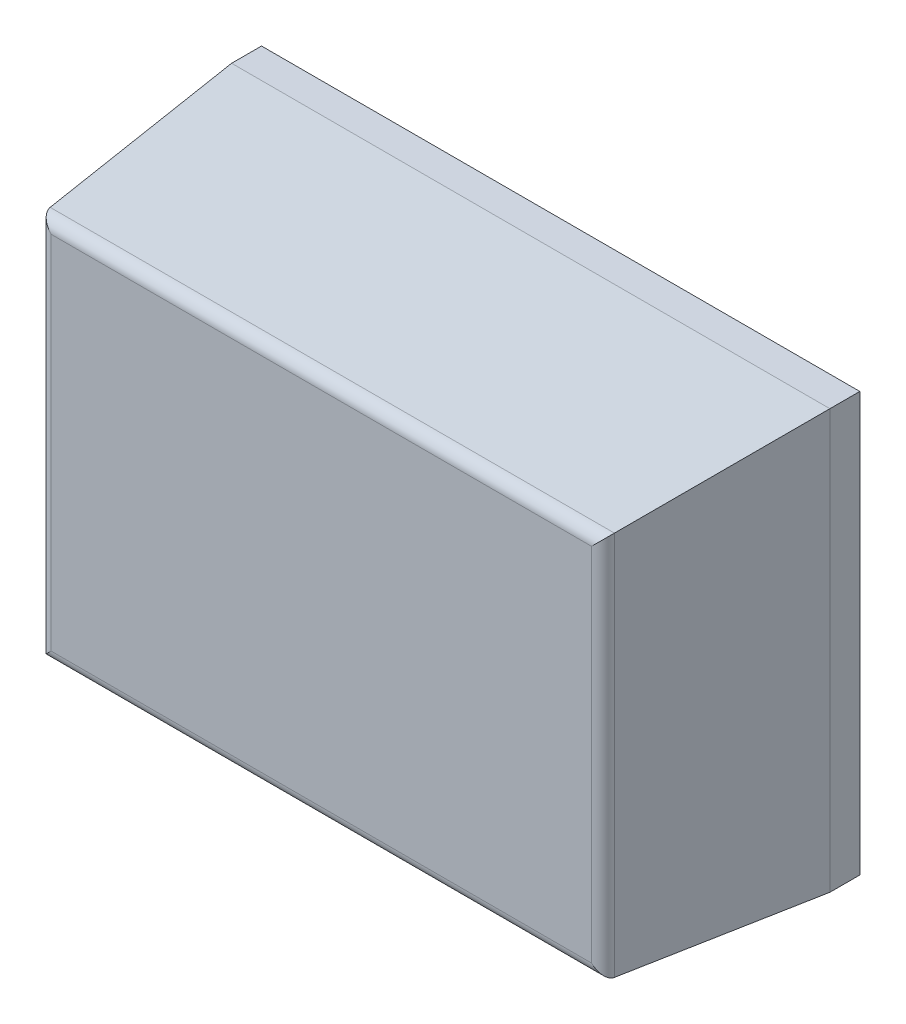
ISO-10303-21;
HEADER;
FILE_DESCRIPTION(('STEP AP214'),'2;1');
FILE_NAME('part.step','',(''),(''),'','','');
FILE_SCHEMA(('AUTOMOTIVE_DESIGN { 1 0 10303 214 1 1 1 1 }'));
ENDSEC;
DATA;
#1=APPLICATION_CONTEXT('core data for automotive mechanical design processes');
#2=APPLICATION_PROTOCOL_DEFINITION('international standard','automotive_design',2000,#1);
#3=PRODUCT_CONTEXT('',#1,'mechanical');
#4=PRODUCT('Part','Part','',(#3));
#5=PRODUCT_RELATED_PRODUCT_CATEGORY('part','',(#4));
#6=PRODUCT_DEFINITION_FORMATION('','',#4);
#7=PRODUCT_DEFINITION_CONTEXT('part definition',#1,'design');
#8=PRODUCT_DEFINITION('design','',#6,#7);
#9=PRODUCT_DEFINITION_SHAPE('','',#8);
#10=(LENGTH_UNIT() NAMED_UNIT(*) SI_UNIT(.MILLI.,.METRE.));
#11=(NAMED_UNIT(*) PLANE_ANGLE_UNIT() SI_UNIT($,.RADIAN.));
#12=(NAMED_UNIT(*) SI_UNIT($,.STERADIAN.) SOLID_ANGLE_UNIT());
#13=UNCERTAINTY_MEASURE_WITH_UNIT(LENGTH_MEASURE(1.E-05),#10,'distance_accuracy_value','');
#14=(GEOMETRIC_REPRESENTATION_CONTEXT(3) GLOBAL_UNCERTAINTY_ASSIGNED_CONTEXT((#13)) GLOBAL_UNIT_ASSIGNED_CONTEXT((#10,
#11,#12)) REPRESENTATION_CONTEXT('',''));
#15=CARTESIAN_POINT('',(0.,0.,0.));
#16=DIRECTION('',(0.,0.,1.));
#17=DIRECTION('',(1.,0.,0.));
#18=AXIS2_PLACEMENT_3D('',#15,#16,#17);
#19=CARTESIAN_POINT('',(-0.5,0.35,0.2));
#20=DIRECTION('',(0.,0.,1.));
#21=DIRECTION('',(1.,0.,0.));
#22=AXIS2_PLACEMENT_3D('',#19,#20,#21);
#23=PLANE('',#22);
#24=DIRECTION('',(0.,1.,0.));
#25=VECTOR('',#24,1.);
#26=CARTESIAN_POINT('',(0.5,0.35,0.2));
#27=LINE('',#26,#25);
#28=CARTESIAN_POINT('',(0.5,-0.35,0.2));
#29=VERTEX_POINT('',#28);
#30=CARTESIAN_POINT('',(0.5,0.35,0.2));
#31=VERTEX_POINT('',#30);
#32=EDGE_CURVE('E11',#29,#31,#27,.T.);
#33=ORIENTED_EDGE('',*,*,#32,.F.);
#34=DIRECTION('',(1.,0.,0.));
#35=VECTOR('',#34,1.);
#36=CARTESIAN_POINT('',(-0.5,-0.35,0.2));
#37=LINE('',#36,#35);
#38=CARTESIAN_POINT('',(-0.5,-0.35,0.2));
#39=VERTEX_POINT('',#38);
#40=EDGE_CURVE('E25',#39,#29,#37,.T.);
#41=ORIENTED_EDGE('',*,*,#40,.F.);
#42=DIRECTION('',(0.,-1.,0.));
#43=VECTOR('',#42,1.);
#44=CARTESIAN_POINT('',(-0.5,0.35,0.2));
#45=LINE('',#44,#43);
#46=CARTESIAN_POINT('',(-0.5,0.35,0.2));
#47=VERTEX_POINT('',#46);
#48=EDGE_CURVE('E217',#47,#39,#45,.T.);
#49=ORIENTED_EDGE('',*,*,#48,.F.);
#50=DIRECTION('',(-1.,0.,0.));
#51=VECTOR('',#50,1.);
#52=CARTESIAN_POINT('',(-0.5,0.35,0.2));
#53=LINE('',#52,#51);
#54=EDGE_CURVE('E212',#31,#47,#53,.T.);
#55=ORIENTED_EDGE('',*,*,#54,.F.);
#56=EDGE_LOOP('',(#33,#41,#49,#55));
#57=FACE_BOUND('',#56,.T.);
#58=ADVANCED_FACE('F17',(#57),#23,.F.);
#59=CARTESIAN_POINT('',(-0.5,0.35,0.2));
#60=DIRECTION('',(0.,1.,0.));
#61=DIRECTION('',(0.,0.,1.));
#62=AXIS2_PLACEMENT_3D('',#59,#60,#61);
#63=PLANE('',#62);
#64=DIRECTION('',(0.,0.,-1.));
#65=VECTOR('',#64,1.);
#66=CARTESIAN_POINT('',(0.5,0.35,0.2));
#67=LINE('',#66,#65);
#68=CARTESIAN_POINT('',(0.5,0.35,0.25));
#69=VERTEX_POINT('',#68);
#70=EDGE_CURVE('E207',#69,#31,#67,.T.);
#71=ORIENTED_EDGE('',*,*,#70,.T.);
#72=ORIENTED_EDGE('',*,*,#54,.T.);
#73=DIRECTION('',(0.,0.,1.));
#74=VECTOR('',#73,1.);
#75=CARTESIAN_POINT('',(-0.5,0.35,0.2));
#76=LINE('',#75,#74);
#77=CARTESIAN_POINT('',(-0.5,0.35,0.25));
#78=VERTEX_POINT('',#77);
#79=EDGE_CURVE('E203',#47,#78,#76,.T.);
#80=ORIENTED_EDGE('',*,*,#79,.T.);
#81=DIRECTION('',(1.,0.,0.));
#82=VECTOR('',#81,1.);
#83=CARTESIAN_POINT('',(-0.5,0.35,0.25));
#84=LINE('',#83,#82);
#85=EDGE_CURVE('E199',#78,#69,#84,.T.);
#86=ORIENTED_EDGE('',*,*,#85,.T.);
#87=EDGE_LOOP('',(#71,#72,#80,#86));
#88=FACE_BOUND('',#87,.T.);
#89=ADVANCED_FACE('F239',(#88),#63,.T.);
#90=CARTESIAN_POINT('',(-0.5,0.335,0.425));
#91=DIRECTION('',(0.,0.996346649041754,0.0854011413463989));
#92=DIRECTION('',(0.,-0.0854011413463989,0.996346649041754));
#93=AXIS2_PLACEMENT_3D('',#90,#91,#92);
#94=PLANE('',#93);
#95=ORIENTED_EDGE('',*,*,#85,.F.);
#96=DIRECTION('',(0.0850914041686403,-0.0850914041695603,0.992733048645537));
#97=VECTOR('',#96,1.);
#98=CARTESIAN_POINT('',(-0.5,0.35,0.25));
#99=LINE('',#98,#97);
#100=CARTESIAN_POINT('',(-0.471567883758,0.321567883758,0.581708022827));
#101=VERTEX_POINT('',#100);
#102=EDGE_CURVE('E195',#78,#101,#99,.T.);
#103=ORIENTED_EDGE('',*,*,#102,.T.);
#104=DIRECTION('',(1.,0.,0.));
#105=VECTOR('',#104,1.);
#106=CARTESIAN_POINT('',(-0.5,0.321567883758,0.581708022827));
#107=LINE('',#106,#105);
#108=CARTESIAN_POINT('',(0.471567883758,0.321567883758,0.581708022827));
#109=VERTEX_POINT('',#108);
#110=EDGE_CURVE('E191',#101,#109,#107,.T.);
#111=ORIENTED_EDGE('',*,*,#110,.T.);
#112=DIRECTION('',(0.0850914041686403,0.0850914041695603,-0.992733048645537));
#113=VECTOR('',#112,1.);
#114=CARTESIAN_POINT('',(0.471567883758,0.321567883758,0.581708022827));
#115=LINE('',#114,#113);
#116=EDGE_CURVE('E186',#109,#69,#115,.T.);
#117=ORIENTED_EDGE('',*,*,#116,.T.);
#118=EDGE_LOOP('',(#95,#103,#111,#117));
#119=FACE_BOUND('',#118,.T.);
#120=ADVANCED_FACE('F301',(#119),#94,.T.);
#121=CARTESIAN_POINT('',(0.485,0.35,0.425));
#122=DIRECTION('',(0.996346649041754,0.,0.0854011413463989));
#123=DIRECTION('',(0.0854011413463989,0.,-0.996346649041754));
#124=AXIS2_PLACEMENT_3D('',#121,#122,#123);
#125=PLANE('',#124);
#126=DIRECTION('',(0.,-1.,0.));
#127=VECTOR('',#126,1.);
#128=CARTESIAN_POINT('',(0.5,0.35,0.25));
#129=LINE('',#128,#127);
#130=CARTESIAN_POINT('',(0.5,-0.35,0.25));
#131=VERTEX_POINT('',#130);
#132=EDGE_CURVE('E181',#69,#131,#129,.T.);
#133=ORIENTED_EDGE('',*,*,#132,.F.);
#134=ORIENTED_EDGE('',*,*,#116,.F.);
#135=DIRECTION('',(0.,-1.,0.));
#136=VECTOR('',#135,1.);
#137=CARTESIAN_POINT('',(0.471567883758,0.35,0.581708022827));
#138=LINE('',#137,#136);
#139=CARTESIAN_POINT('',(0.471567883758,-0.321567883758,0.581708022827));
#140=VERTEX_POINT('',#139);
#141=EDGE_CURVE('E96',#109,#140,#138,.T.);
#142=ORIENTED_EDGE('',*,*,#141,.T.);
#143=DIRECTION('',(0.0850914041695603,-0.0850914041686403,-0.992733048645537));
#144=VECTOR('',#143,1.);
#145=CARTESIAN_POINT('',(0.471567883758,-0.321567883758,0.581708022827));
#146=LINE('',#145,#144);
#147=EDGE_CURVE('E174',#140,#131,#146,.T.);
#148=ORIENTED_EDGE('',*,*,#147,.T.);
#149=EDGE_LOOP('',(#133,#134,#142,#148));
#150=FACE_BOUND('',#149,.T.);
#151=ADVANCED_FACE('F299',(#150),#125,.T.);
#152=CARTESIAN_POINT('',(0.5,-0.335,0.425));
#153=DIRECTION('',(0.,-0.996346649041754,0.0854011413463989));
#154=DIRECTION('',(0.,-0.0854011413463989,-0.996346649041754));
#155=AXIS2_PLACEMENT_3D('',#152,#153,#154);
#156=PLANE('',#155);
#157=DIRECTION('',(-1.,0.,0.));
#158=VECTOR('',#157,1.);
#159=CARTESIAN_POINT('',(0.5,-0.35,0.25));
#160=LINE('',#159,#158);
#161=CARTESIAN_POINT('',(-0.5,-0.35,0.25));
#162=VERTEX_POINT('',#161);
#163=EDGE_CURVE('E169',#131,#162,#160,.T.);
#164=ORIENTED_EDGE('',*,*,#163,.F.);
#165=ORIENTED_EDGE('',*,*,#147,.F.);
#166=DIRECTION('',(-1.,0.,0.));
#167=VECTOR('',#166,1.);
#168=CARTESIAN_POINT('',(0.5,-0.321567883758,0.581708022827));
#169=LINE('',#168,#167);
#170=CARTESIAN_POINT('',(-0.471567883758,-0.321567883758,0.581708022827));
#171=VERTEX_POINT('',#170);
#172=EDGE_CURVE('E165',#140,#171,#169,.T.);
#173=ORIENTED_EDGE('',*,*,#172,.T.);
#174=DIRECTION('',(-0.0850914041686403,-0.0850914041695603,-0.992733048645537));
#175=VECTOR('',#174,1.);
#176=CARTESIAN_POINT('',(-0.471567883758,-0.321567883758,0.581708022827));
#177=LINE('',#176,#175);
#178=EDGE_CURVE('E161',#171,#162,#177,.T.);
#179=ORIENTED_EDGE('',*,*,#178,.T.);
#180=EDGE_LOOP('',(#164,#165,#173,#179));
#181=FACE_BOUND('',#180,.T.);
#182=ADVANCED_FACE('F297',(#181),#156,.T.);
#183=CARTESIAN_POINT('',(-0.485,-0.35,0.425));
#184=DIRECTION('',(-0.996346649041754,0.,0.0854011413463989));
#185=DIRECTION('',(0.0854011413463989,0.,0.996346649041754));
#186=AXIS2_PLACEMENT_3D('',#183,#184,#185);
#187=PLANE('',#186);
#188=DIRECTION('',(0.,1.,0.));
#189=VECTOR('',#188,1.);
#190=CARTESIAN_POINT('',(-0.5,-0.35,0.25));
#191=LINE('',#190,#189);
#192=EDGE_CURVE('E156',#162,#78,#191,.T.);
#193=ORIENTED_EDGE('',*,*,#192,.F.);
#194=ORIENTED_EDGE('',*,*,#178,.F.);
#195=DIRECTION('',(0.,1.,0.));
#196=VECTOR('',#195,1.);
#197=CARTESIAN_POINT('',(-0.471567883758,-0.35,0.581708022827));
#198=LINE('',#197,#196);
#199=EDGE_CURVE('E153',#171,#101,#198,.T.);
#200=ORIENTED_EDGE('',*,*,#199,.T.);
#201=ORIENTED_EDGE('',*,*,#102,.F.);
#202=EDGE_LOOP('',(#193,#194,#200,#201));
#203=FACE_BOUND('',#202,.T.);
#204=ADVANCED_FACE('F138',(#203),#187,.T.);
#205=CARTESIAN_POINT('',(-0.451640950777,-0.32,0.58));
#206=DIRECTION('',(0.,1.,0.));
#207=DIRECTION('',(0.676239180560668,0.,-0.736682136796214));
#208=AXIS2_PLACEMENT_3D('',#205,#206,#207);
#209=CYLINDRICAL_SURFACE('',#208,0.02);
#210=CARTESIAN_POINT('',(-0.471567883758,0.32156788375783,0.581708022826985));
#211=CARTESIAN_POINT('',(-0.471551727795134,0.321551731479085,0.581896506763114));
#212=CARTESIAN_POINT('',(-0.471532759682752,0.321532919301659,0.582084514918313));
#213=CARTESIAN_POINT('',(-0.471489078952539,0.321489757738137,0.582461996934878));
#214=CARTESIAN_POINT('',(-0.471464287756522,0.321465332718423,0.582651453075838));
#215=CARTESIAN_POINT('',(-0.471408912364911,0.321410799969963,0.583031580355878));
#216=CARTESIAN_POINT('',(-0.471378248700226,0.321380614307769,0.583222228699494));
#217=CARTESIAN_POINT('',(-0.47131107890762,0.321314431763723,0.583604487010148));
#218=CARTESIAN_POINT('',(-0.471274492602823,0.32127835506417,0.583796069044787));
#219=CARTESIAN_POINT('',(-0.471195428086438,0.321200273523743,0.584179932365754));
#220=CARTESIAN_POINT('',(-0.471152869175294,0.321158187319179,0.584372180449682));
#221=CARTESIAN_POINT('',(-0.471061809767721,0.321067983638131,0.584757107018937));
#222=CARTESIAN_POINT('',(-0.471013228217733,0.321019783622758,0.584949746956732));
#223=CARTESIAN_POINT('',(-0.47091007370475,0.320917263054385,0.585335182063272));
#224=CARTESIAN_POINT('',(-0.470855419491702,0.320862859156513,0.585527933285159));
#225=CARTESIAN_POINT('',(-0.47074006966782,0.320747856027288,0.585913310333214));
#226=CARTESIAN_POINT('',(-0.470679292755623,0.320687173018955,0.586105886789123));
#227=CARTESIAN_POINT('',(-0.470551647409076,0.320559551745822,0.586490628948457));
#228=CARTESIAN_POINT('',(-0.470484697755693,0.320492529645734,0.586682739860511));
#229=CARTESIAN_POINT('',(-0.470344656672683,0.320352185536295,0.587066261660601));
#230=CARTESIAN_POINT('',(-0.470271484228804,0.320278780005591,0.587257612364601));
#231=CARTESIAN_POINT('',(-0.470118947192902,0.320125639986742,0.587639321399986));
#232=CARTESIAN_POINT('',(-0.470039501903228,0.320045822659709,0.587829614208043));
#233=CARTESIAN_POINT('',(-0.469874368694536,0.319879845885239,0.588208912899906));
#234=CARTESIAN_POINT('',(-0.469788600496177,0.319793604644383,0.588397847998412));
#235=CARTESIAN_POINT('',(-0.469610770896591,0.319614782996068,0.588774135416278));
#236=CARTESIAN_POINT('',(-0.469518629726671,0.319522122196588,0.588961411788545));
#237=CARTESIAN_POINT('',(-0.469328003500394,0.319330480638771,0.589334085524827));
#238=CARTESIAN_POINT('',(-0.469229439268993,0.319231421236545,0.589519401902006));
#239=CARTESIAN_POINT('',(-0.469025916238091,0.319027018144096,0.589887859973393));
#240=CARTESIAN_POINT('',(-0.4689208789336,0.318921597896426,0.590070915783537));
#241=CARTESIAN_POINT('',(-0.46870435868994,0.318704524881692,0.590434558619133));
#242=CARTESIAN_POINT('',(-0.46859279797801,0.318592797963754,0.590615055026427));
#243=CARTESIAN_POINT('',(-0.468363213433941,0.318363213448402,0.590973236644766));
#244=CARTESIAN_POINT('',(-0.468245113976744,0.318245285678935,0.591150828332857));
#245=CARTESIAN_POINT('',(-0.468002693647495,0.318003415627032,0.591502871693966));
#246=CARTESIAN_POINT('',(-0.467878304619444,0.317879408362017,0.591677231700415));
#247=CARTESIAN_POINT('',(-0.467623541190084,0.31762550940119,0.592022499022453));
#248=CARTESIAN_POINT('',(-0.46749310540421,0.317495557732981,0.592193316869583));
#249=CARTESIAN_POINT('',(-0.46722648537221,0.317229920027927,0.592531195751427));
#250=CARTESIAN_POINT('',(-0.467090246048208,0.317094179015641,0.592698170034532));
#251=CARTESIAN_POINT('',(-0.466812256103006,0.316817131506477,0.593028067824574));
#252=CARTESIAN_POINT('',(-0.466670456243824,0.316675774961448,0.593190907752845));
#253=CARTESIAN_POINT('',(-0.466381583322479,0.31638768426811,0.593512253664269));
#254=CARTESIAN_POINT('',(-0.466234466420036,0.316240904899782,0.593670679631231));
#255=CARTESIAN_POINT('',(-0.465935196248181,0.315942172093988,0.593982928895655));
#256=CARTESIAN_POINT('',(-0.465783004087945,0.315790178098804,0.594136676107873));
#257=CARTESIAN_POINT('',(-0.465473827084078,0.315481244240543,0.594439305621932));
#258=CARTESIAN_POINT('',(-0.465316807968135,0.315324268399624,0.594588115988287));
#259=CARTESIAN_POINT('',(-0.464836613831796,0.314843966284375,0.595029010683966));
#260=CARTESIAN_POINT('',(-0.464508824324442,0.314515779347878,0.595310851871193));
#261=CARTESIAN_POINT('',(-0.46383706887011,0.313842778403866,0.595852610223296));
#262=CARTESIAN_POINT('',(-0.46349292131585,0.31349777512481,0.596112064672054));
#263=CARTESIAN_POINT('',(-0.462790346105894,0.312793341105602,0.596607594170717));
#264=CARTESIAN_POINT('',(-0.46243178569062,0.312433775702793,0.596843289125202));
#265=CARTESIAN_POINT('',(-0.46170216337257,0.311702752848736,0.597290045835448));
#266=CARTESIAN_POINT('',(-0.461331007992186,0.311331208656905,0.597500812277371));
#267=CARTESIAN_POINT('',(-0.460579032919507,0.310578830949797,0.597896821550661));
#268=CARTESIAN_POINT('',(-0.460198166074543,0.310197952736955,0.598081889480456));
#269=CARTESIAN_POINT('',(-0.459429902211747,0.309429321752991,0.598426038207282));
#270=CARTESIAN_POINT('',(-0.459042493051077,0.309041556108242,0.598585063021871));
#271=CARTESIAN_POINT('',(-0.458263245496496,0.308261652310067,0.598876957131385));
#272=CARTESIAN_POINT('',(-0.457871412793398,0.307869519781803,0.599009856705617));
#273=CARTESIAN_POINT('',(-0.457085594444896,0.307083231671765,0.599249668464613));
#274=CARTESIAN_POINT('',(-0.456691626598652,0.306689093306781,0.599356695669239));
#275=CARTESIAN_POINT('',(-0.455903774062478,0.305901129562763,0.59954517015578));
#276=CARTESIAN_POINT('',(-0.455509913868093,0.30550732685349,0.59962681502329));
#277=CARTESIAN_POINT('',(-0.454724532027235,0.304722280896785,0.59976518163241));
#278=CARTESIAN_POINT('',(-0.45433303605203,0.304331060756815,0.599822180819522));
#279=CARTESIAN_POINT('',(-0.453554634194773,0.303553333134018,0.599912150667091));
#280=CARTESIAN_POINT('',(-0.453167749704672,0.303166845103785,0.599945475545916));
#281=CARTESIAN_POINT('',(-0.452400850965396,0.302400578759218,0.5999891767153));
#282=CARTESIAN_POINT('',(-0.452020847451603,0.302020814116612,0.599999981396023));
#283=CARTESIAN_POINT('',(-0.451640950777,0.301640950777,0.6));
#284=B_SPLINE_CURVE_WITH_KNOTS('',3,(#210,#211,#212,#213,#214,#215,#216,#217,#218,#219,#220,
#221,#222,#223,#224,#225,#226,#227,#228,#229,#230,#231,#232,#233,#234,#235,#236,#237,#238,#239,
#240,#241,#242,#243,#244,#245,#246,#247,#248,#249,#250,#251,#252,#253,#254,#255,#256,#257,#258,
#259,#260,#261,#262,#263,#264,#265,#266,#267,#268,#269,#270,#271,#272,#273,#274,#275,#276,#277,
#278,#279,#280,#281,#282,#283),.UNSPECIFIED.,.F.,.F.,(4,2,2,2,2,2,2,2,2,2,2,2,2,2,2,2,2,2,2,2,2,
2,2,2,2,2,2,2,2,2,2,2,2,2,2,2,4),(0.,0.000569540585877464,0.00114725960959311,
0.0017334333687568,0.00232833300809898,0.00293222480541771,0.00354537045851166,
0.00416802737081397,0.00480044893375471,0.00544288480417263,0.00609558117536734,
0.00675878104063561,0.00743272444835911,0.00811764874791708,0.00881378882587556,
0.00952137733206772,0.0102406448953136,0.010971615361222,0.0117139437434972,0.0124672738176561,
0.0132312100464975,0.0140053216676411,0.01478914631976,0.015582193258962,0.0163839462122068,
0.0180112218062293,0.0196666019044473,0.021345261567426,0.0230421514479178,0.0247500767093373,
0.0264616264692611,0.028171180683284,0.0298729889469467,0.0315611972929606,0.0332298720190544,
0.0348730216491241,0.0364846180932809),.UNSPECIFIED.);
#285=CARTESIAN_POINT('',(-0.451640950777,0.301640950777,0.6));
#286=VERTEX_POINT('',#285);
#287=EDGE_CURVE('E106',#101,#286,#284,.T.);
#288=ORIENTED_EDGE('',*,*,#287,.F.);
#289=ORIENTED_EDGE('',*,*,#199,.F.);
#290=CARTESIAN_POINT('',(-0.451640950777,-0.301640950777,0.6));
#291=CARTESIAN_POINT('',(-0.452020847451603,-0.302020814116612,0.599999981396023));
#292=CARTESIAN_POINT('',(-0.452400850965396,-0.302400578759218,0.5999891767153));
#293=CARTESIAN_POINT('',(-0.453167749704672,-0.303166845103785,0.599945475545916));
#294=CARTESIAN_POINT('',(-0.453554634194773,-0.303553333134018,0.599912150667091));
#295=CARTESIAN_POINT('',(-0.45433303605203,-0.304331060756815,0.599822180819522));
#296=CARTESIAN_POINT('',(-0.454724532027235,-0.304722280896786,0.59976518163241));
#297=CARTESIAN_POINT('',(-0.455509913868093,-0.30550732685349,0.59962681502329));
#298=CARTESIAN_POINT('',(-0.455903774062478,-0.305901129562763,0.59954517015578));
#299=CARTESIAN_POINT('',(-0.456691626598652,-0.306689093306781,0.599356695669239));
#300=CARTESIAN_POINT('',(-0.457085594444896,-0.307083231671765,0.599249668464613));
#301=CARTESIAN_POINT('',(-0.457871412793398,-0.307869519781803,0.599009856705617));
#302=CARTESIAN_POINT('',(-0.458263245496497,-0.308261652310067,0.598876957131385));
#303=CARTESIAN_POINT('',(-0.459042493051078,-0.309041556108242,0.598585063021871));
#304=CARTESIAN_POINT('',(-0.459429902211747,-0.309429321752991,0.598426038207282));
#305=CARTESIAN_POINT('',(-0.460198166074544,-0.310197952736955,0.598081889480456));
#306=CARTESIAN_POINT('',(-0.460579032919508,-0.310578830949797,0.597896821550661));
#307=CARTESIAN_POINT('',(-0.461331007992186,-0.311331208656905,0.597500812277371));
#308=CARTESIAN_POINT('',(-0.46170216337257,-0.311702752848736,0.597290045835448));
#309=CARTESIAN_POINT('',(-0.46243178569062,-0.312433775702793,0.596843289125202));
#310=CARTESIAN_POINT('',(-0.462790346105894,-0.312793341105602,0.596607594170717));
#311=CARTESIAN_POINT('',(-0.46349292131585,-0.31349777512481,0.596112064672054));
#312=CARTESIAN_POINT('',(-0.46383706887011,-0.313842778403866,0.595852610223296));
#313=CARTESIAN_POINT('',(-0.464508824324442,-0.314515779347878,0.595310851871193));
#314=CARTESIAN_POINT('',(-0.464836613831796,-0.314843966284375,0.595029010683967));
#315=CARTESIAN_POINT('',(-0.465316807968135,-0.315324268399624,0.594588115988287));
#316=CARTESIAN_POINT('',(-0.465473827084079,-0.315481244240543,0.594439305621932));
#317=CARTESIAN_POINT('',(-0.465783004087945,-0.315790178098804,0.594136676107873));
#318=CARTESIAN_POINT('',(-0.465935196248181,-0.315942172093988,0.593982928895655));
#319=CARTESIAN_POINT('',(-0.466234466420036,-0.316240904899782,0.593670679631231));
#320=CARTESIAN_POINT('',(-0.466381583322479,-0.31638768426811,0.593512253664269));
#321=CARTESIAN_POINT('',(-0.466670456243824,-0.316675774961448,0.593190907752845));
#322=CARTESIAN_POINT('',(-0.466812256103006,-0.316817131506477,0.593028067824574));
#323=CARTESIAN_POINT('',(-0.467090246048208,-0.317094179015641,0.592698170034532));
#324=CARTESIAN_POINT('',(-0.467226485372211,-0.317229920027927,0.592531195751427));
#325=CARTESIAN_POINT('',(-0.46749310540421,-0.317495557732981,0.592193316869583));
#326=CARTESIAN_POINT('',(-0.467623541190084,-0.31762550940119,0.592022499022453));
#327=CARTESIAN_POINT('',(-0.467878304619444,-0.317879408362017,0.591677231700415));
#328=CARTESIAN_POINT('',(-0.468002693647495,-0.318003415627032,0.591502871693966));
#329=CARTESIAN_POINT('',(-0.468245113976744,-0.318245285678935,0.591150828332857));
#330=CARTESIAN_POINT('',(-0.468363213433941,-0.318363213448402,0.590973236644766));
#331=CARTESIAN_POINT('',(-0.468592797978009,-0.318592797963754,0.590615055026427));
#332=CARTESIAN_POINT('',(-0.46870435868994,-0.318704524881692,0.590434558619133));
#333=CARTESIAN_POINT('',(-0.4689208789336,-0.318921597896426,0.590070915783537));
#334=CARTESIAN_POINT('',(-0.469025916238091,-0.319027018144096,0.589887859973393));
#335=CARTESIAN_POINT('',(-0.469229439268993,-0.319231421236545,0.589519401902006));
#336=CARTESIAN_POINT('',(-0.469328003500394,-0.319330480638771,0.589334085524827));
#337=CARTESIAN_POINT('',(-0.469518629726671,-0.319522122196588,0.588961411788545));
#338=CARTESIAN_POINT('',(-0.469610770896591,-0.319614782996068,0.588774135416278));
#339=CARTESIAN_POINT('',(-0.469788600496177,-0.319793604644383,0.588397847998412));
#340=CARTESIAN_POINT('',(-0.469874368694536,-0.319879845885239,0.588208912899906));
#341=CARTESIAN_POINT('',(-0.470039501903228,-0.320045822659709,0.587829614208043));
#342=CARTESIAN_POINT('',(-0.470118947192902,-0.320125639986742,0.587639321399986));
#343=CARTESIAN_POINT('',(-0.470271484228803,-0.320278780005591,0.587257612364601));
#344=CARTESIAN_POINT('',(-0.470344656672683,-0.320352185536295,0.587066261660601));
#345=CARTESIAN_POINT('',(-0.470484697755693,-0.320492529645734,0.586682739860511));
#346=CARTESIAN_POINT('',(-0.470551647409076,-0.320559551745822,0.586490628948457));
#347=CARTESIAN_POINT('',(-0.470679292755623,-0.320687173018955,0.586105886789123));
#348=CARTESIAN_POINT('',(-0.47074006966782,-0.320747856027288,0.585913310333214));
#349=CARTESIAN_POINT('',(-0.470855419491701,-0.320862859156513,0.585527933285159));
#350=CARTESIAN_POINT('',(-0.47091007370475,-0.320917263054385,0.585335182063272));
#351=CARTESIAN_POINT('',(-0.471013228217733,-0.321019783622758,0.584949746956732));
#352=CARTESIAN_POINT('',(-0.471061809767721,-0.321067983638131,0.584757107018937));
#353=CARTESIAN_POINT('',(-0.471152869175294,-0.321158187319179,0.584372180449682));
#354=CARTESIAN_POINT('',(-0.471195428086438,-0.321200273523743,0.584179932365754));
#355=CARTESIAN_POINT('',(-0.471274492602822,-0.32127835506417,0.583796069044787));
#356=CARTESIAN_POINT('',(-0.47131107890762,-0.321314431763723,0.583604487010148));
#357=CARTESIAN_POINT('',(-0.471378248700226,-0.321380614307769,0.583222228699494));
#358=CARTESIAN_POINT('',(-0.47140891236491,-0.321410799969963,0.583031580355878));
#359=CARTESIAN_POINT('',(-0.471464287756521,-0.321465332718423,0.582651453075838));
#360=CARTESIAN_POINT('',(-0.471489078952538,-0.321489757738137,0.582461996934878));
#361=CARTESIAN_POINT('',(-0.471532759682752,-0.321532919301659,0.582084514918312));
#362=CARTESIAN_POINT('',(-0.471551727795134,-0.321551731479085,0.581896506763114));
#363=CARTESIAN_POINT('',(-0.471567883758,-0.32156788375783,0.581708022826985));
#364=B_SPLINE_CURVE_WITH_KNOTS('',3,(#290,#291,#292,#293,#294,#295,#296,#297,#298,#299,#300,
#301,#302,#303,#304,#305,#306,#307,#308,#309,#310,#311,#312,#313,#314,#315,#316,#317,#318,#319,
#320,#321,#322,#323,#324,#325,#326,#327,#328,#329,#330,#331,#332,#333,#334,#335,#336,#337,#338,
#339,#340,#341,#342,#343,#344,#345,#346,#347,#348,#349,#350,#351,#352,#353,#354,#355,#356,#357,
#358,#359,#360,#361,#362,#363),.UNSPECIFIED.,.F.,.F.,(4,2,2,2,2,2,2,2,2,2,2,2,2,2,2,2,2,2,2,2,2,
2,2,2,2,2,2,2,2,2,2,2,2,2,2,2,4),(0.,0.00161159644415689,0.00325474607422664,
0.00492342080032039,0.00661162914633429,0.00831343740999706,0.0100229916240199,
0.0117345413839438,0.0134424666453632,0.0151393565258552,0.0168180161888337,0.0184733962870516,
0.0201006718810742,0.0209024248343189,0.0216954717735209,0.0224792964256397,0.0232534080467834,
0.0240173442756249,0.0247706743497836,0.025513002732059,0.0262439731979672,0.0269632407612131,
0.0276708292674052,0.0283669693453639,0.0290518936449218,0.0297258370526453,0.0303890369179134,
0.0310417332891083,0.0316841691595261,0.0323165907224669,0.0329392476347691,0.0335523932878631,
0.0341562850851818,0.034751184724524,0.0353373584836877,0.0359150775074034,0.0364846180932808),.UNSPECIFIED.);
#365=CARTESIAN_POINT('',(-0.451640950777,-0.301640950777,0.6));
#366=VERTEX_POINT('',#365);
#367=EDGE_CURVE('E120',#366,#171,#364,.T.);
#368=ORIENTED_EDGE('',*,*,#367,.F.);
#369=DIRECTION('',(0.,1.,0.));
#370=VECTOR('',#369,1.);
#371=CARTESIAN_POINT('',(-0.451640950777,-0.32,0.6));
#372=LINE('',#371,#370);
#373=EDGE_CURVE('E116',#366,#286,#372,.T.);
#374=ORIENTED_EDGE('',*,*,#373,.T.);
#375=EDGE_LOOP('',(#288,#289,#368,#374));
#376=FACE_BOUND('',#375,.T.);
#377=ADVANCED_FACE('F128',(#376),#209,.T.);
#378=CARTESIAN_POINT('',(-0.5,0.35,0.6));
#379=DIRECTION('',(0.,0.,1.));
#380=DIRECTION('',(1.,0.,0.));
#381=AXIS2_PLACEMENT_3D('',#378,#379,#380);
#382=PLANE('',#381);
#383=DIRECTION('',(-1.,0.,0.));
#384=VECTOR('',#383,1.);
#385=CARTESIAN_POINT('',(0.47,-0.301640950777,0.6));
#386=LINE('',#385,#384);
#387=CARTESIAN_POINT('',(0.451640950777,-0.301640950777,0.6));
#388=VERTEX_POINT('',#387);
#389=EDGE_CURVE('E86',#388,#366,#386,.T.);
#390=ORIENTED_EDGE('',*,*,#389,.F.);
#391=DIRECTION('',(0.,-1.,0.));
#392=VECTOR('',#391,1.);
#393=CARTESIAN_POINT('',(0.451640950777,0.32,0.6));
#394=LINE('',#393,#392);
#395=CARTESIAN_POINT('',(0.451640950777,0.301640950777,0.6));
#396=VERTEX_POINT('',#395);
#397=EDGE_CURVE('E78',#396,#388,#394,.T.);
#398=ORIENTED_EDGE('',*,*,#397,.F.);
#399=DIRECTION('',(1.,0.,0.));
#400=VECTOR('',#399,1.);
#401=CARTESIAN_POINT('',(-0.47,0.301640950777,0.6));
#402=LINE('',#401,#400);
#403=EDGE_CURVE('E83',#286,#396,#402,.T.);
#404=ORIENTED_EDGE('',*,*,#403,.F.);
#405=ORIENTED_EDGE('',*,*,#373,.F.);
#406=EDGE_LOOP('',(#390,#398,#404,#405));
#407=FACE_BOUND('',#406,.T.);
#408=ADVANCED_FACE('F80',(#407),#382,.T.);
#409=CARTESIAN_POINT('',(-0.47,0.301640950777,0.58));
#410=DIRECTION('',(1.,0.,0.));
#411=DIRECTION('',(0.,-0.676239180560669,-0.736682136796214));
#412=AXIS2_PLACEMENT_3D('',#409,#410,#411);
#413=CYLINDRICAL_SURFACE('',#412,0.02);
#414=CARTESIAN_POINT('',(0.451640950777,0.301640950777,0.6));
#415=CARTESIAN_POINT('',(0.452020847451603,0.302020814116612,0.599999981396023));
#416=CARTESIAN_POINT('',(0.452400850965397,0.302400578759218,0.5999891767153));
#417=CARTESIAN_POINT('',(0.453167749704673,0.303166845103785,0.599945475545916));
#418=CARTESIAN_POINT('',(0.453554634194773,0.303553333134018,0.599912150667091));
#419=CARTESIAN_POINT('',(0.45433303605203,0.304331060756815,0.599822180819522));
#420=CARTESIAN_POINT('',(0.454724532027235,0.304722280896786,0.59976518163241));
#421=CARTESIAN_POINT('',(0.455509913868093,0.30550732685349,0.59962681502329));
#422=CARTESIAN_POINT('',(0.455903774062478,0.305901129562763,0.59954517015578));
#423=CARTESIAN_POINT('',(0.456691626598652,0.306689093306781,0.599356695669239));
#424=CARTESIAN_POINT('',(0.457085594444896,0.307083231671765,0.599249668464613));
#425=CARTESIAN_POINT('',(0.457871412793398,0.307869519781803,0.599009856705617));
#426=CARTESIAN_POINT('',(0.458263245496497,0.308261652310067,0.598876957131385));
#427=CARTESIAN_POINT('',(0.459042493051078,0.309041556108242,0.598585063021871));
#428=CARTESIAN_POINT('',(0.459429902211747,0.309429321752991,0.598426038207282));
#429=CARTESIAN_POINT('',(0.460198166074544,0.310197952736955,0.598081889480456));
#430=CARTESIAN_POINT('',(0.460579032919508,0.310578830949797,0.597896821550661));
#431=CARTESIAN_POINT('',(0.461331007992186,0.311331208656905,0.597500812277371));
#432=CARTESIAN_POINT('',(0.46170216337257,0.311702752848736,0.597290045835448));
#433=CARTESIAN_POINT('',(0.46243178569062,0.312433775702793,0.596843289125202));
#434=CARTESIAN_POINT('',(0.462790346105894,0.312793341105602,0.596607594170717));
#435=CARTESIAN_POINT('',(0.463492921315851,0.31349777512481,0.596112064672054));
#436=CARTESIAN_POINT('',(0.46383706887011,0.313842778403866,0.595852610223296));
#437=CARTESIAN_POINT('',(0.464508824324443,0.314515779347878,0.595310851871193));
#438=CARTESIAN_POINT('',(0.464836613831796,0.314843966284375,0.595029010683967));
#439=CARTESIAN_POINT('',(0.465316807968135,0.315324268399624,0.594588115988287));
#440=CARTESIAN_POINT('',(0.465473827084079,0.315481244240543,0.594439305621932));
#441=CARTESIAN_POINT('',(0.465783004087945,0.315790178098804,0.594136676107873));
#442=CARTESIAN_POINT('',(0.465935196248181,0.315942172093988,0.593982928895655));
#443=CARTESIAN_POINT('',(0.466234466420036,0.316240904899782,0.593670679631231));
#444=CARTESIAN_POINT('',(0.466381583322479,0.31638768426811,0.593512253664269));
#445=CARTESIAN_POINT('',(0.466670456243824,0.316675774961448,0.593190907752845));
#446=CARTESIAN_POINT('',(0.466812256103006,0.316817131506477,0.593028067824574));
#447=CARTESIAN_POINT('',(0.467090246048208,0.317094179015641,0.592698170034532));
#448=CARTESIAN_POINT('',(0.467226485372211,0.317229920027927,0.592531195751427));
#449=CARTESIAN_POINT('',(0.467493105404211,0.317495557732981,0.592193316869583));
#450=CARTESIAN_POINT('',(0.467623541190084,0.31762550940119,0.592022499022453));
#451=CARTESIAN_POINT('',(0.467878304619444,0.317879408362017,0.591677231700415));
#452=CARTESIAN_POINT('',(0.468002693647495,0.318003415627032,0.591502871693966));
#453=CARTESIAN_POINT('',(0.468245113976745,0.318245285678935,0.591150828332857));
#454=CARTESIAN_POINT('',(0.468363213433941,0.318363213448402,0.590973236644766));
#455=CARTESIAN_POINT('',(0.46859279797801,0.318592797963754,0.590615055026427));
#456=CARTESIAN_POINT('',(0.46870435868994,0.318704524881692,0.590434558619133));
#457=CARTESIAN_POINT('',(0.4689208789336,0.318921597896426,0.590070915783537));
#458=CARTESIAN_POINT('',(0.469025916238091,0.319027018144096,0.589887859973393));
#459=CARTESIAN_POINT('',(0.469229439268993,0.319231421236545,0.589519401902006));
#460=CARTESIAN_POINT('',(0.469328003500394,0.319330480638771,0.589334085524827));
#461=CARTESIAN_POINT('',(0.469518629726671,0.319522122196588,0.588961411788545));
#462=CARTESIAN_POINT('',(0.469610770896591,0.319614782996068,0.588774135416278));
#463=CARTESIAN_POINT('',(0.469788600496177,0.319793604644383,0.588397847998412));
#464=CARTESIAN_POINT('',(0.469874368694536,0.319879845885239,0.588208912899906));
#465=CARTESIAN_POINT('',(0.470039501903228,0.320045822659709,0.587829614208043));
#466=CARTESIAN_POINT('',(0.470118947192902,0.320125639986742,0.587639321399986));
#467=CARTESIAN_POINT('',(0.470271484228804,0.320278780005591,0.587257612364601));
#468=CARTESIAN_POINT('',(0.470344656672683,0.320352185536295,0.587066261660601));
#469=CARTESIAN_POINT('',(0.470484697755693,0.320492529645734,0.586682739860511));
#470=CARTESIAN_POINT('',(0.470551647409076,0.320559551745822,0.586490628948457));
#471=CARTESIAN_POINT('',(0.470679292755624,0.320687173018955,0.586105886789123));
#472=CARTESIAN_POINT('',(0.47074006966782,0.320747856027288,0.585913310333214));
#473=CARTESIAN_POINT('',(0.470855419491702,0.320862859156513,0.585527933285159));
#474=CARTESIAN_POINT('',(0.47091007370475,0.320917263054385,0.585335182063272));
#475=CARTESIAN_POINT('',(0.471013228217733,0.321019783622758,0.584949746956732));
#476=CARTESIAN_POINT('',(0.471061809767721,0.321067983638131,0.584757107018937));
#477=CARTESIAN_POINT('',(0.471152869175294,0.321158187319179,0.584372180449682));
#478=CARTESIAN_POINT('',(0.471195428086438,0.321200273523743,0.584179932365754));
#479=CARTESIAN_POINT('',(0.471274492602823,0.32127835506417,0.583796069044787));
#480=CARTESIAN_POINT('',(0.47131107890762,0.321314431763723,0.583604487010148));
#481=CARTESIAN_POINT('',(0.471378248700226,0.321380614307769,0.583222228699494));
#482=CARTESIAN_POINT('',(0.47140891236491,0.321410799969963,0.583031580355878));
#483=CARTESIAN_POINT('',(0.471464287756522,0.321465332718423,0.582651453075838));
#484=CARTESIAN_POINT('',(0.471489078952539,0.321489757738137,0.582461996934878));
#485=CARTESIAN_POINT('',(0.471532759682752,0.321532919301659,0.582084514918313));
#486=CARTESIAN_POINT('',(0.471551727795134,0.321551731479085,0.581896506763114));
#487=CARTESIAN_POINT('',(0.471567883758,0.32156788375783,0.581708022826985));
#488=B_SPLINE_CURVE_WITH_KNOTS('',3,(#414,#415,#416,#417,#418,#419,#420,#421,#422,#423,#424,
#425,#426,#427,#428,#429,#430,#431,#432,#433,#434,#435,#436,#437,#438,#439,#440,#441,#442,#443,
#444,#445,#446,#447,#448,#449,#450,#451,#452,#453,#454,#455,#456,#457,#458,#459,#460,#461,#462,
#463,#464,#465,#466,#467,#468,#469,#470,#471,#472,#473,#474,#475,#476,#477,#478,#479,#480,#481,
#482,#483,#484,#485,#486,#487),.UNSPECIFIED.,.F.,.F.,(4,2,2,2,2,2,2,2,2,2,2,2,2,2,2,2,2,2,2,2,2,
2,2,2,2,2,2,2,2,2,2,2,2,2,2,2,4),(0.,0.00161159644415689,0.00325474607422661,
0.00492342080032036,0.00661162914633425,0.00831343740999706,0.0100229916240199,
0.0117345413839438,0.0134424666453632,0.0151393565258552,0.0168180161888337,0.0184733962870517,
0.0201006718810742,0.0209024248343189,0.0216954717735209,0.0224792964256397,0.0232534080467835,
0.0240173442756249,0.0247706743497836,0.025513002732059,0.0262439731979672,0.0269632407612131,
0.0276708292674053,0.0283669693453639,0.0290518936449218,0.0297258370526453,0.0303890369179134,
0.0310417332891083,0.0316841691595261,0.0323165907224668,0.0329392476347691,0.0335523932878631,
0.0341562850851818,0.034751184724524,0.0353373584836878,0.0359150775074033,0.0364846180932808),.UNSPECIFIED.);
#489=EDGE_CURVE('E93',#396,#109,#488,.T.);
#490=ORIENTED_EDGE('',*,*,#489,.T.);
#491=ORIENTED_EDGE('',*,*,#110,.F.);
#492=ORIENTED_EDGE('',*,*,#287,.T.);
#493=ORIENTED_EDGE('',*,*,#403,.T.);
#494=EDGE_LOOP('',(#490,#491,#492,#493));
#495=FACE_BOUND('',#494,.T.);
#496=ADVANCED_FACE('F104',(#495),#413,.T.);
#497=CARTESIAN_POINT('',(0.451640950777,0.32,0.58));
#498=DIRECTION('',(0.,-1.,0.));
#499=DIRECTION('',(-0.676239180560668,0.,-0.736682136796214));
#500=AXIS2_PLACEMENT_3D('',#497,#498,#499);
#501=CYLINDRICAL_SURFACE('',#500,0.02);
#502=ORIENTED_EDGE('',*,*,#141,.F.);
#503=ORIENTED_EDGE('',*,*,#489,.F.);
#504=ORIENTED_EDGE('',*,*,#397,.T.);
#505=CARTESIAN_POINT('',(0.451640950777,-0.301640950777,0.6));
#506=CARTESIAN_POINT('',(0.452020814116612,-0.302020847451603,0.599999981396023));
#507=CARTESIAN_POINT('',(0.452400578759218,-0.302400850965396,0.5999891767153));
#508=CARTESIAN_POINT('',(0.453166845103785,-0.303167749704672,0.599945475545916));
#509=CARTESIAN_POINT('',(0.453553333134018,-0.303554634194773,0.599912150667091));
#510=CARTESIAN_POINT('',(0.454331060756815,-0.30433303605203,0.599822180819522));
#511=CARTESIAN_POINT('',(0.454722280896786,-0.304724532027235,0.59976518163241));
#512=CARTESIAN_POINT('',(0.45550732685349,-0.305509913868093,0.59962681502329));
#513=CARTESIAN_POINT('',(0.455901129562763,-0.305903774062478,0.59954517015578));
#514=CARTESIAN_POINT('',(0.456689093306781,-0.306691626598652,0.599356695669239));
#515=CARTESIAN_POINT('',(0.457083231671765,-0.307085594444896,0.599249668464613));
#516=CARTESIAN_POINT('',(0.457869519781803,-0.307871412793398,0.599009856705617));
#517=CARTESIAN_POINT('',(0.458261652310067,-0.308263245496497,0.598876957131385));
#518=CARTESIAN_POINT('',(0.459041556108242,-0.309042493051078,0.598585063021871));
#519=CARTESIAN_POINT('',(0.459429321752991,-0.309429902211747,0.598426038207282));
#520=CARTESIAN_POINT('',(0.460197952736955,-0.310198166074544,0.598081889480456));
#521=CARTESIAN_POINT('',(0.460578830949797,-0.310579032919507,0.597896821550661));
#522=CARTESIAN_POINT('',(0.461331208656905,-0.311331007992186,0.597500812277371));
#523=CARTESIAN_POINT('',(0.461702752848736,-0.31170216337257,0.597290045835448));
#524=CARTESIAN_POINT('',(0.462433775702793,-0.31243178569062,0.596843289125202));
#525=CARTESIAN_POINT('',(0.462793341105602,-0.312790346105894,0.596607594170717));
#526=CARTESIAN_POINT('',(0.46349777512481,-0.31349292131585,0.596112064672054));
#527=CARTESIAN_POINT('',(0.463842778403866,-0.31383706887011,0.595852610223296));
#528=CARTESIAN_POINT('',(0.464515779347878,-0.314508824324442,0.595310851871193));
#529=CARTESIAN_POINT('',(0.464843966284375,-0.314836613831796,0.595029010683966));
#530=CARTESIAN_POINT('',(0.465324268399624,-0.315316807968135,0.594588115988287));
#531=CARTESIAN_POINT('',(0.465481244240543,-0.315473827084079,0.594439305621932));
#532=CARTESIAN_POINT('',(0.465790178098804,-0.315783004087945,0.594136676107873));
#533=CARTESIAN_POINT('',(0.465942172093988,-0.315935196248181,0.593982928895655));
#534=CARTESIAN_POINT('',(0.466240904899782,-0.316234466420036,0.593670679631231));
#535=CARTESIAN_POINT('',(0.46638768426811,-0.316381583322479,0.593512253664269));
#536=CARTESIAN_POINT('',(0.466675774961448,-0.316670456243824,0.593190907752845));
#537=CARTESIAN_POINT('',(0.466817131506477,-0.316812256103006,0.593028067824574));
#538=CARTESIAN_POINT('',(0.467094179015641,-0.317090246048208,0.592698170034532));
#539=CARTESIAN_POINT('',(0.467229920027927,-0.31722648537221,0.592531195751427));
#540=CARTESIAN_POINT('',(0.467495557732981,-0.31749310540421,0.592193316869583));
#541=CARTESIAN_POINT('',(0.46762550940119,-0.317623541190084,0.592022499022453));
#542=CARTESIAN_POINT('',(0.467879408362017,-0.317878304619444,0.591677231700415));
#543=CARTESIAN_POINT('',(0.468003415627032,-0.318002693647495,0.591502871693966));
#544=CARTESIAN_POINT('',(0.468245285678935,-0.318245113976744,0.591150828332857));
#545=CARTESIAN_POINT('',(0.468363213448402,-0.318363213433941,0.590973236644766));
#546=CARTESIAN_POINT('',(0.468592797963754,-0.318592797978009,0.590615055026427));
#547=CARTESIAN_POINT('',(0.468704524881692,-0.31870435868994,0.590434558619133));
#548=CARTESIAN_POINT('',(0.468921597896426,-0.3189208789336,0.590070915783537));
#549=CARTESIAN_POINT('',(0.469027018144096,-0.319025916238091,0.589887859973393));
#550=CARTESIAN_POINT('',(0.469231421236545,-0.319229439268993,0.589519401902006));
#551=CARTESIAN_POINT('',(0.469330480638771,-0.319328003500393,0.589334085524827));
#552=CARTESIAN_POINT('',(0.469522122196588,-0.31951862972667,0.588961411788545));
#553=CARTESIAN_POINT('',(0.469614782996068,-0.319610770896591,0.588774135416278));
#554=CARTESIAN_POINT('',(0.469793604644383,-0.319788600496177,0.588397847998412));
#555=CARTESIAN_POINT('',(0.469879845885239,-0.319874368694536,0.588208912899906));
#556=CARTESIAN_POINT('',(0.470045822659709,-0.320039501903228,0.587829614208043));
#557=CARTESIAN_POINT('',(0.470125639986742,-0.320118947192902,0.587639321399986));
#558=CARTESIAN_POINT('',(0.470278780005591,-0.320271484228803,0.587257612364601));
#559=CARTESIAN_POINT('',(0.470352185536295,-0.320344656672683,0.587066261660601));
#560=CARTESIAN_POINT('',(0.470492529645734,-0.320484697755693,0.586682739860511));
#561=CARTESIAN_POINT('',(0.470559551745822,-0.320551647409076,0.586490628948457));
#562=CARTESIAN_POINT('',(0.470687173018955,-0.320679292755624,0.586105886789123));
#563=CARTESIAN_POINT('',(0.470747856027288,-0.32074006966782,0.585913310333214));
#564=CARTESIAN_POINT('',(0.470862859156513,-0.320855419491702,0.585527933285159));
#565=CARTESIAN_POINT('',(0.470917263054385,-0.32091007370475,0.585335182063272));
#566=CARTESIAN_POINT('',(0.471019783622758,-0.321013228217733,0.584949746956732));
#567=CARTESIAN_POINT('',(0.471067983638131,-0.321061809767721,0.584757107018937));
#568=CARTESIAN_POINT('',(0.471158187319179,-0.321152869175294,0.584372180449682));
#569=CARTESIAN_POINT('',(0.471200273523743,-0.321195428086438,0.584179932365754));
#570=CARTESIAN_POINT('',(0.47127835506417,-0.321274492602823,0.583796069044787));
#571=CARTESIAN_POINT('',(0.471314431763723,-0.32131107890762,0.583604487010148));
#572=CARTESIAN_POINT('',(0.471380614307769,-0.321378248700226,0.583222228699494));
#573=CARTESIAN_POINT('',(0.471410799969963,-0.321408912364911,0.583031580355878));
#574=CARTESIAN_POINT('',(0.471465332718424,-0.321464287756522,0.582651453075838));
#575=CARTESIAN_POINT('',(0.471489757738137,-0.321489078952539,0.582461996934878));
#576=CARTESIAN_POINT('',(0.471532919301659,-0.321532759682752,0.582084514918313));
#577=CARTESIAN_POINT('',(0.471551731479085,-0.321551727795134,0.581896506763114));
#578=CARTESIAN_POINT('',(0.47156788375783,-0.321567883758,0.581708022826985));
#579=B_SPLINE_CURVE_WITH_KNOTS('',3,(#505,#506,#507,#508,#509,#510,#511,#512,#513,#514,#515,
#516,#517,#518,#519,#520,#521,#522,#523,#524,#525,#526,#527,#528,#529,#530,#531,#532,#533,#534,
#535,#536,#537,#538,#539,#540,#541,#542,#543,#544,#545,#546,#547,#548,#549,#550,#551,#552,#553,
#554,#555,#556,#557,#558,#559,#560,#561,#562,#563,#564,#565,#566,#567,#568,#569,#570,#571,#572,
#573,#574,#575,#576,#577,#578),.UNSPECIFIED.,.F.,.F.,(4,2,2,2,2,2,2,2,2,2,2,2,2,2,2,2,2,2,2,2,2,
2,2,2,2,2,2,2,2,2,2,2,2,2,2,2,4),(0.,0.00161159644415682,0.00325474607422657,
0.00492342080032039,0.00661162914633429,0.00831343740999708,0.01002299162402,0.0117345413839438,
0.0134424666453632,0.0151393565258551,0.0168180161888337,0.0184733962870517,0.0201006718810742,
0.020902424834319,0.0216954717735209,0.0224792964256398,0.0232534080467835,0.0240173442756249,
0.0247706743497837,0.025513002732059,0.0262439731979672,0.0269632407612132,0.0276708292674053,
0.0283669693453638,0.0290518936449218,0.0297258370526453,0.0303890369179135,0.0310417332891083,
0.0316841691595262,0.0323165907224669,0.0329392476347692,0.0335523932878632,0.0341562850851819,
0.0347511847245241,0.0353373584836878,0.0359150775074035,0.0364846180932809),.UNSPECIFIED.);
#580=EDGE_CURVE('E101',#388,#140,#579,.T.);
#581=ORIENTED_EDGE('',*,*,#580,.T.);
#582=EDGE_LOOP('',(#502,#503,#504,#581));
#583=FACE_BOUND('',#582,.T.);
#584=ADVANCED_FACE('F95',(#583),#501,.T.);
#585=CARTESIAN_POINT('',(0.47,-0.301640950777,0.58));
#586=DIRECTION('',(-1.,0.,0.));
#587=DIRECTION('',(0.,0.676239180560669,-0.736682136796214));
#588=AXIS2_PLACEMENT_3D('',#585,#586,#587);
#589=CYLINDRICAL_SURFACE('',#588,0.02);
#590=ORIENTED_EDGE('',*,*,#172,.F.);
#591=ORIENTED_EDGE('',*,*,#580,.F.);
#592=ORIENTED_EDGE('',*,*,#389,.T.);
#593=ORIENTED_EDGE('',*,*,#367,.T.);
#594=EDGE_LOOP('',(#590,#591,#592,#593));
#595=FACE_BOUND('',#594,.T.);
#596=ADVANCED_FACE('F256',(#595),#589,.T.);
#597=CARTESIAN_POINT('',(-0.5,-0.35,0.2));
#598=DIRECTION('',(-1.,0.,0.));
#599=DIRECTION('',(0.,0.,1.));
#600=AXIS2_PLACEMENT_3D('',#597,#598,#599);
#601=PLANE('',#600);
#602=ORIENTED_EDGE('',*,*,#79,.F.);
#603=ORIENTED_EDGE('',*,*,#48,.T.);
#604=DIRECTION('',(0.,0.,-1.));
#605=VECTOR('',#604,1.);
#606=CARTESIAN_POINT('',(-0.5,-0.35,0.2));
#607=LINE('',#606,#605);
#608=EDGE_CURVE('E231',#162,#39,#607,.T.);
#609=ORIENTED_EDGE('',*,*,#608,.F.);
#610=ORIENTED_EDGE('',*,*,#192,.T.);
#611=EDGE_LOOP('',(#602,#603,#609,#610));
#612=FACE_BOUND('',#611,.T.);
#613=ADVANCED_FACE('F236',(#612),#601,.T.);
#614=CARTESIAN_POINT('',(0.5,-0.35,0.2));
#615=DIRECTION('',(0.,-1.,0.));
#616=DIRECTION('',(0.,0.,-1.));
#617=AXIS2_PLACEMENT_3D('',#614,#615,#616);
#618=PLANE('',#617);
#619=ORIENTED_EDGE('',*,*,#608,.T.);
#620=ORIENTED_EDGE('',*,*,#40,.T.);
#621=DIRECTION('',(0.,0.,-1.));
#622=VECTOR('',#621,1.);
#623=CARTESIAN_POINT('',(0.5,-0.35,0.2));
#624=LINE('',#623,#622);
#625=EDGE_CURVE('E229',#131,#29,#624,.T.);
#626=ORIENTED_EDGE('',*,*,#625,.F.);
#627=ORIENTED_EDGE('',*,*,#163,.T.);
#628=EDGE_LOOP('',(#619,#620,#626,#627));
#629=FACE_BOUND('',#628,.T.);
#630=ADVANCED_FACE('F228',(#629),#618,.T.);
#631=CARTESIAN_POINT('',(0.5,0.35,0.2));
#632=DIRECTION('',(1.,0.,0.));
#633=DIRECTION('',(0.,0.,-1.));
#634=AXIS2_PLACEMENT_3D('',#631,#632,#633);
#635=PLANE('',#634);
#636=ORIENTED_EDGE('',*,*,#625,.T.);
#637=ORIENTED_EDGE('',*,*,#32,.T.);
#638=ORIENTED_EDGE('',*,*,#70,.F.);
#639=ORIENTED_EDGE('',*,*,#132,.T.);
#640=EDGE_LOOP('',(#636,#637,#638,#639));
#641=FACE_BOUND('',#640,.T.);
#642=ADVANCED_FACE('F242',(#641),#635,.T.);
#643=CLOSED_SHELL('',(#58,#89,#120,#151,#182,#204,#377,#408,#496,#584,#596,#613,#630,#642));
#644=MANIFOLD_SOLID_BREP('B1',#643);
#645=ADVANCED_BREP_SHAPE_REPRESENTATION('',(#18,#644),#14);
#646=SHAPE_DEFINITION_REPRESENTATION(#9,#645);
ENDSEC;
END-ISO-10303-21;
